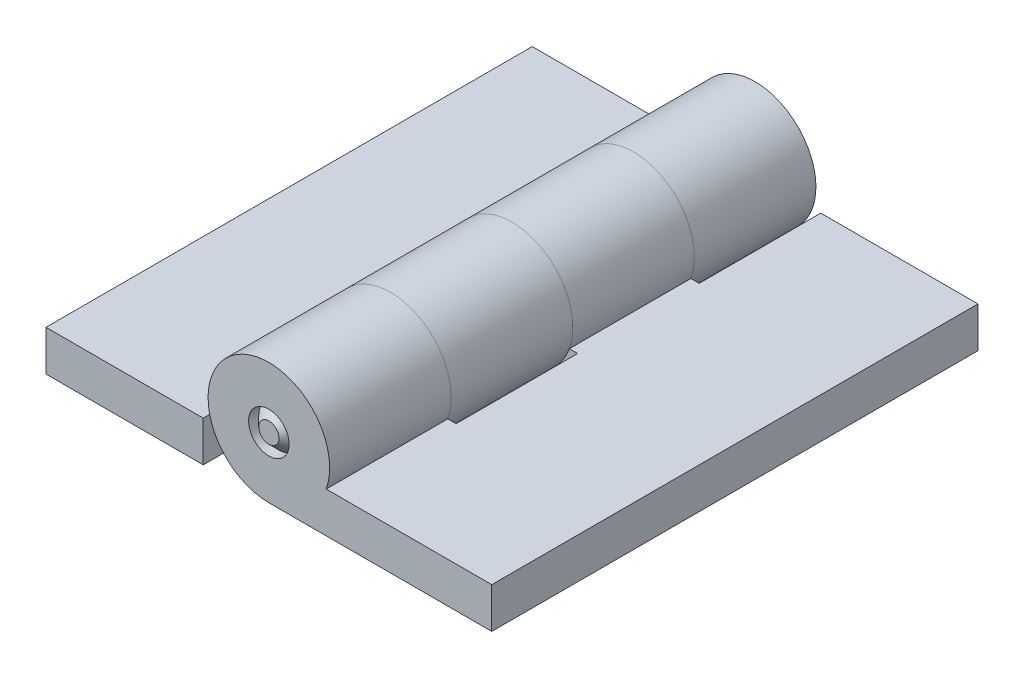
ISO-10303-21;
HEADER;
FILE_DESCRIPTION(('STEP AP214'),'2;1');
FILE_NAME('part.step','',(''),(''),'','','');
FILE_SCHEMA(('AUTOMOTIVE_DESIGN { 1 0 10303 214 1 1 1 1 }'));
ENDSEC;
DATA;
#1=APPLICATION_CONTEXT('core data for automotive mechanical design processes');
#2=APPLICATION_PROTOCOL_DEFINITION('international standard','automotive_design',2000,#1);
#3=PRODUCT_CONTEXT('',#1,'mechanical');
#4=PRODUCT('Part','Part','',(#3));
#5=PRODUCT_RELATED_PRODUCT_CATEGORY('part','',(#4));
#6=PRODUCT_DEFINITION_FORMATION('','',#4);
#7=PRODUCT_DEFINITION_CONTEXT('part definition',#1,'design');
#8=PRODUCT_DEFINITION('design','',#6,#7);
#9=PRODUCT_DEFINITION_SHAPE('','',#8);
#10=(LENGTH_UNIT() NAMED_UNIT(*) SI_UNIT(.MILLI.,.METRE.));
#11=(NAMED_UNIT(*) PLANE_ANGLE_UNIT() SI_UNIT($,.RADIAN.));
#12=(NAMED_UNIT(*) SI_UNIT($,.STERADIAN.) SOLID_ANGLE_UNIT());
#13=UNCERTAINTY_MEASURE_WITH_UNIT(LENGTH_MEASURE(1.E-05),#10,'distance_accuracy_value','');
#14=(GEOMETRIC_REPRESENTATION_CONTEXT(3) GLOBAL_UNCERTAINTY_ASSIGNED_CONTEXT((#13)) GLOBAL_UNIT_ASSIGNED_CONTEXT((#10,
#11,#12)) REPRESENTATION_CONTEXT('',''));
#15=CARTESIAN_POINT('',(0.,0.,0.));
#16=DIRECTION('',(0.,0.,1.));
#17=DIRECTION('',(1.,0.,0.));
#18=AXIS2_PLACEMENT_3D('',#15,#16,#17);
#19=CARTESIAN_POINT('',(0.,0.,-16.66875));
#20=DIRECTION('',(0.,0.,-1.));
#21=DIRECTION('',(1.,0.,0.));
#22=AXIS2_PLACEMENT_3D('',#19,#20,#21);
#23=SPHERICAL_SURFACE('',#22,3.96875);
#24=CARTESIAN_POINT('',(0.,0.,-19.05));
#25=DIRECTION('',(0.,0.,-1.));
#26=DIRECTION('',(-1.,0.,0.));
#27=AXIS2_PLACEMENT_3D('',#24,#25,#26);
#28=CIRCLE('',#27,3.175);
#29=CARTESIAN_POINT('',(-3.175,0.,-19.05));
#30=VERTEX_POINT('',#29);
#31=EDGE_CURVE('E58',#30,#30,#28,.T.);
#32=ORIENTED_EDGE('',*,*,#31,.T.);
#33=EDGE_LOOP('',(#32));
#34=FACE_BOUND('',#33,.T.);
#35=ADVANCED_FACE('F43',(#34),#23,.T.);
#36=CARTESIAN_POINT('',(0.,0.,-20.6375));
#37=DIRECTION('',(0.,0.,-1.));
#38=DIRECTION('',(-1.,0.,0.));
#39=AXIS2_PLACEMENT_3D('',#36,#37,#38);
#40=CYLINDRICAL_SURFACE('',#39,1.5875);
#41=CARTESIAN_POINT('',(0.,0.,18.25625));
#42=DIRECTION('',(0.,0.,-1.));
#43=DIRECTION('',(-1.,0.,0.));
#44=AXIS2_PLACEMENT_3D('',#41,#42,#43);
#45=CIRCLE('',#44,1.5875);
#46=CARTESIAN_POINT('',(-1.5875,0.,18.25625));
#47=VERTEX_POINT('',#46);
#48=EDGE_CURVE('E11',#47,#47,#45,.T.);
#49=ORIENTED_EDGE('',*,*,#48,.T.);
#50=EDGE_LOOP('',(#49));
#51=FACE_BOUND('',#50,.T.);
#52=CARTESIAN_POINT('',(0.,0.,-19.05));
#53=DIRECTION('',(0.,0.,-1.));
#54=DIRECTION('',(-1.,0.,0.));
#55=AXIS2_PLACEMENT_3D('',#52,#53,#54);
#56=CIRCLE('',#55,1.5875);
#57=CARTESIAN_POINT('',(-1.5875,0.,-19.05));
#58=VERTEX_POINT('',#57);
#59=EDGE_CURVE('E54',#58,#58,#56,.T.);
#60=ORIENTED_EDGE('',*,*,#59,.F.);
#61=EDGE_LOOP('',(#60));
#62=FACE_BOUND('',#61,.T.);
#63=ADVANCED_FACE('F68',(#51,#62),#40,.T.);
#64=CARTESIAN_POINT('',(-3.175,0.,-19.05));
#65=DIRECTION('',(0.,0.,1.));
#66=DIRECTION('',(1.,0.,0.));
#67=AXIS2_PLACEMENT_3D('',#64,#65,#66);
#68=PLANE('',#67);
#69=ORIENTED_EDGE('',*,*,#59,.T.);
#70=EDGE_LOOP('',(#69));
#71=FACE_BOUND('',#70,.T.);
#72=ORIENTED_EDGE('',*,*,#31,.F.);
#73=EDGE_LOOP('',(#72));
#74=FACE_BOUND('',#73,.T.);
#75=ADVANCED_FACE('F65',(#71,#74),#68,.T.);
#76=CARTESIAN_POINT('',(-17.4625,-4.76255,19.05));
#77=DIRECTION('',(0.,0.,-1.));
#78=DIRECTION('',(-1.,0.,0.));
#79=AXIS2_PLACEMENT_3D('',#76,#77,#78);
#80=PLANE('',#79);
#81=CARTESIAN_POINT('',(0.,0.,19.05));
#82=DIRECTION('',(0.,0.,-1.));
#83=DIRECTION('',(-1.,0.,0.));
#84=AXIS2_PLACEMENT_3D('',#81,#82,#83);
#85=CIRCLE('',#84,0.793749999999999);
#86=CARTESIAN_POINT('',(-0.793749999999999,0.,19.05));
#87=VERTEX_POINT('',#86);
#88=EDGE_CURVE('E50',#87,#87,#85,.F.);
#89=ORIENTED_EDGE('',*,*,#88,.T.);
#90=EDGE_LOOP('',(#89));
#91=FACE_BOUND('',#90,.T.);
#92=ADVANCED_FACE('F67',(#91),#80,.F.);
#93=CARTESIAN_POINT('',(0.,0.,19.05));
#94=DIRECTION('',(0.,0.,-1.));
#95=DIRECTION('',(-1.,0.,0.));
#96=AXIS2_PLACEMENT_3D('',#93,#94,#95);
#97=CONICAL_SURFACE('',#96,0.793750000000003,0.785398163397449);
#98=ORIENTED_EDGE('',*,*,#48,.F.);
#99=EDGE_LOOP('',(#98));
#100=FACE_BOUND('',#99,.T.);
#101=ORIENTED_EDGE('',*,*,#88,.F.);
#102=EDGE_LOOP('',(#101));
#103=FACE_BOUND('',#102,.T.);
#104=ADVANCED_FACE('F45',(#100,#103),#97,.T.);
#105=CLOSED_SHELL('',(#35,#63,#75,#92,#104));
#106=MANIFOLD_SOLID_BREP('B2',#105);
#107=CARTESIAN_POINT('',(-5.1435,-1.5875,19.05));
#108=DIRECTION('',(-1.,0.,0.));
#109=DIRECTION('',(0.,-1.,0.));
#110=AXIS2_PLACEMENT_3D('',#107,#108,#109);
#111=PLANE('',#110);
#112=DIRECTION('',(0.,-1.,0.));
#113=VECTOR('',#112,1.);
#114=CARTESIAN_POINT('',(-5.1435,-1.5875,0.));
#115=LINE('',#114,#113);
#116=CARTESIAN_POINT('',(-5.1435,-1.5875,0.));
#117=VERTEX_POINT('',#116);
#118=CARTESIAN_POINT('',(-5.1435,-4.7625,0.));
#119=VERTEX_POINT('',#118);
#120=EDGE_CURVE('E141',#117,#119,#115,.T.);
#121=ORIENTED_EDGE('',*,*,#120,.T.);
#122=DIRECTION('',(0.,0.,-1.));
#123=VECTOR('',#122,1.);
#124=CARTESIAN_POINT('',(-5.1435,-4.7625,19.05));
#125=LINE('',#124,#123);
#126=CARTESIAN_POINT('',(-5.1435,-4.7625,-9.525));
#127=VERTEX_POINT('',#126);
#128=EDGE_CURVE('E127',#119,#127,#125,.T.);
#129=ORIENTED_EDGE('',*,*,#128,.T.);
#130=DIRECTION('',(0.,-1.,0.));
#131=VECTOR('',#130,1.);
#132=CARTESIAN_POINT('',(-5.1435,-4.7625,-9.525));
#133=LINE('',#132,#131);
#134=CARTESIAN_POINT('',(-5.1435,-1.5875,-9.52499999999998));
#135=VERTEX_POINT('',#134);
#136=EDGE_CURVE('E251',#135,#127,#133,.T.);
#137=ORIENTED_EDGE('',*,*,#136,.F.);
#138=DIRECTION('',(0.,0.,-1.));
#139=VECTOR('',#138,1.);
#140=CARTESIAN_POINT('',(-5.1435,-1.5875,19.05));
#141=LINE('',#140,#139);
#142=EDGE_CURVE('E148',#117,#135,#141,.T.);
#143=ORIENTED_EDGE('',*,*,#142,.F.);
#144=EDGE_LOOP('',(#121,#129,#137,#143));
#145=FACE_BOUND('',#144,.T.);
#146=ADVANCED_FACE('F123',(#145),#111,.F.);
#147=CARTESIAN_POINT('',(-5.1435,-4.7625,19.05));
#148=VERTEX_POINT('',#147);
#149=CARTESIAN_POINT('',(-5.1435,-4.7625,9.525));
#150=VERTEX_POINT('',#149);
#151=EDGE_CURVE('E133',#148,#150,#125,.T.);
#152=ORIENTED_EDGE('',*,*,#151,.T.);
#153=DIRECTION('',(0.,-1.,0.));
#154=VECTOR('',#153,1.);
#155=CARTESIAN_POINT('',(-5.1435,-1.5875,9.525));
#156=LINE('',#155,#154);
#157=CARTESIAN_POINT('',(-5.1435,-1.5875,9.525));
#158=VERTEX_POINT('',#157);
#159=EDGE_CURVE('E227',#158,#150,#156,.T.);
#160=ORIENTED_EDGE('',*,*,#159,.F.);
#161=CARTESIAN_POINT('',(-5.1435,-1.5875,19.05));
#162=VERTEX_POINT('',#161);
#163=EDGE_CURVE('E263',#162,#158,#141,.T.);
#164=ORIENTED_EDGE('',*,*,#163,.F.);
#165=DIRECTION('',(0.,1.,0.));
#166=VECTOR('',#165,1.);
#167=CARTESIAN_POINT('',(-5.1435,-1.5875,19.05));
#168=LINE('',#167,#166);
#169=EDGE_CURVE('E291',#148,#162,#168,.T.);
#170=ORIENTED_EDGE('',*,*,#169,.F.);
#171=EDGE_LOOP('',(#152,#160,#164,#170));
#172=FACE_BOUND('',#171,.T.);
#173=ADVANCED_FACE('F321',(#172),#111,.F.);
#174=CARTESIAN_POINT('',(-17.4625,-1.5875,19.05));
#175=DIRECTION('',(1.,0.,0.));
#176=DIRECTION('',(0.,0.,-1.));
#177=AXIS2_PLACEMENT_3D('',#174,#175,#176);
#178=PLANE('',#177);
#179=DIRECTION('',(0.,-1.,0.));
#180=VECTOR('',#179,1.);
#181=CARTESIAN_POINT('',(-17.4625,-1.5875,-19.05));
#182=LINE('',#181,#180);
#183=CARTESIAN_POINT('',(-17.4625,-1.5875,-19.05));
#184=VERTEX_POINT('',#183);
#185=CARTESIAN_POINT('',(-17.4625,-4.7625,-19.05));
#186=VERTEX_POINT('',#185);
#187=EDGE_CURVE('E295',#184,#186,#182,.T.);
#188=ORIENTED_EDGE('',*,*,#187,.T.);
#189=DIRECTION('',(0.,0.,-1.));
#190=VECTOR('',#189,1.);
#191=CARTESIAN_POINT('',(-17.4625,-4.7625,19.05));
#192=LINE('',#191,#190);
#193=CARTESIAN_POINT('',(-17.4625,-4.7625,19.05));
#194=VERTEX_POINT('',#193);
#195=EDGE_CURVE('E41',#194,#186,#192,.T.);
#196=ORIENTED_EDGE('',*,*,#195,.F.);
#197=DIRECTION('',(0.,-1.,0.));
#198=VECTOR('',#197,1.);
#199=CARTESIAN_POINT('',(-17.4625,-1.5875,19.05));
#200=LINE('',#199,#198);
#201=CARTESIAN_POINT('',(-17.4625,-1.5875,19.05));
#202=VERTEX_POINT('',#201);
#203=EDGE_CURVE('E285',#202,#194,#200,.T.);
#204=ORIENTED_EDGE('',*,*,#203,.F.);
#205=DIRECTION('',(0.,0.,-1.));
#206=VECTOR('',#205,1.);
#207=CARTESIAN_POINT('',(-17.4625,-1.5875,19.05));
#208=LINE('',#207,#206);
#209=EDGE_CURVE('E264',#202,#184,#208,.T.);
#210=ORIENTED_EDGE('',*,*,#209,.T.);
#211=EDGE_LOOP('',(#188,#196,#204,#210));
#212=FACE_BOUND('',#211,.T.);
#213=ADVANCED_FACE('F125',(#212),#178,.F.);
#214=CARTESIAN_POINT('',(-17.4625,-4.7625,19.05));
#215=DIRECTION('',(0.,1.,0.));
#216=DIRECTION('',(0.,0.,1.));
#217=AXIS2_PLACEMENT_3D('',#214,#215,#216);
#218=PLANE('',#217);
#219=DIRECTION('',(1.,0.,0.));
#220=VECTOR('',#219,1.);
#221=CARTESIAN_POINT('',(-17.4625,-4.7625,-19.05));
#222=LINE('',#221,#220);
#223=CARTESIAN_POINT('',(0.,-4.7625,-19.05));
#224=VERTEX_POINT('',#223);
#225=EDGE_CURVE('E298',#186,#224,#222,.T.);
#226=ORIENTED_EDGE('',*,*,#225,.T.);
#227=DIRECTION('',(0.,0.,-1.));
#228=VECTOR('',#227,1.);
#229=CARTESIAN_POINT('',(0.,-4.7625,4.21743286321604));
#230=LINE('',#229,#228);
#231=CARTESIAN_POINT('',(0.,-4.7625,-9.525));
#232=VERTEX_POINT('',#231);
#233=EDGE_CURVE('E462',#232,#224,#230,.T.);
#234=ORIENTED_EDGE('',*,*,#233,.F.);
#235=DIRECTION('',(1.,0.,0.));
#236=VECTOR('',#235,1.);
#237=CARTESIAN_POINT('',(0.,-4.7625,-9.525));
#238=LINE('',#237,#236);
#239=EDGE_CURVE('E256',#127,#232,#238,.T.);
#240=ORIENTED_EDGE('',*,*,#239,.F.);
#241=ORIENTED_EDGE('',*,*,#128,.F.);
#242=DIRECTION('',(1.,0.,0.));
#243=VECTOR('',#242,1.);
#244=CARTESIAN_POINT('',(-5.1435,-4.7625,0.));
#245=LINE('',#244,#243);
#246=CARTESIAN_POINT('',(0.,-4.7625,0.));
#247=VERTEX_POINT('',#246);
#248=EDGE_CURVE('E211',#119,#247,#245,.T.);
#249=ORIENTED_EDGE('',*,*,#248,.T.);
#250=DIRECTION('',(0.,0.,-1.));
#251=VECTOR('',#250,1.);
#252=CARTESIAN_POINT('',(0.,-4.7625,23.267432863216));
#253=LINE('',#252,#251);
#254=CARTESIAN_POINT('',(0.,-4.7625,9.525));
#255=VERTEX_POINT('',#254);
#256=EDGE_CURVE('E203',#255,#247,#253,.T.);
#257=ORIENTED_EDGE('',*,*,#256,.F.);
#258=DIRECTION('',(1.,0.,0.));
#259=VECTOR('',#258,1.);
#260=CARTESIAN_POINT('',(-5.1435,-4.7625,9.525));
#261=LINE('',#260,#259);
#262=EDGE_CURVE('E208',#150,#255,#261,.T.);
#263=ORIENTED_EDGE('',*,*,#262,.F.);
#264=ORIENTED_EDGE('',*,*,#151,.F.);
#265=DIRECTION('',(1.,0.,0.));
#266=VECTOR('',#265,1.);
#267=CARTESIAN_POINT('',(-17.4625,-4.7625,19.05));
#268=LINE('',#267,#266);
#269=EDGE_CURVE('E288',#194,#148,#268,.T.);
#270=ORIENTED_EDGE('',*,*,#269,.F.);
#271=ORIENTED_EDGE('',*,*,#195,.T.);
#272=EDGE_LOOP('',(#226,#234,#240,#241,#249,#257,#263,#264,#270,#271));
#273=FACE_BOUND('',#272,.T.);
#274=ADVANCED_FACE('F205',(#273),#218,.F.);
#275=CARTESIAN_POINT('',(-17.4625,-1.5875,19.05));
#276=DIRECTION('',(0.,-1.,0.));
#277=DIRECTION('',(0.,0.,-1.));
#278=AXIS2_PLACEMENT_3D('',#275,#276,#277);
#279=PLANE('',#278);
#280=DIRECTION('',(-1.,0.,0.));
#281=VECTOR('',#280,1.);
#282=CARTESIAN_POINT('',(-17.4625,-1.5875,-19.05));
#283=LINE('',#282,#281);
#284=CARTESIAN_POINT('',(-4.49012806053458,-1.5875,-19.05));
#285=VERTEX_POINT('',#284);
#286=EDGE_CURVE('E289',#285,#184,#283,.T.);
#287=ORIENTED_EDGE('',*,*,#286,.T.);
#288=ORIENTED_EDGE('',*,*,#209,.F.);
#289=DIRECTION('',(-1.,0.,0.));
#290=VECTOR('',#289,1.);
#291=CARTESIAN_POINT('',(-17.4625,-1.5875,19.05));
#292=LINE('',#291,#290);
#293=EDGE_CURVE('E293',#162,#202,#292,.T.);
#294=ORIENTED_EDGE('',*,*,#293,.F.);
#295=ORIENTED_EDGE('',*,*,#163,.T.);
#296=DIRECTION('',(-1.,0.,0.));
#297=VECTOR('',#296,1.);
#298=CARTESIAN_POINT('',(-4.49012806053458,-1.5875,9.525));
#299=LINE('',#298,#297);
#300=CARTESIAN_POINT('',(-4.49012806053458,-1.5875,9.525));
#301=VERTEX_POINT('',#300);
#302=EDGE_CURVE('E223',#301,#158,#299,.T.);
#303=ORIENTED_EDGE('',*,*,#302,.F.);
#304=DIRECTION('',(0.,0.,-1.));
#305=VECTOR('',#304,1.);
#306=CARTESIAN_POINT('',(-4.49012806053458,-1.5875,23.267432863216));
#307=LINE('',#306,#305);
#308=CARTESIAN_POINT('',(-4.49012806053458,-1.5875,0.));
#309=VERTEX_POINT('',#308);
#310=EDGE_CURVE('E215',#301,#309,#307,.T.);
#311=ORIENTED_EDGE('',*,*,#310,.T.);
#312=DIRECTION('',(-1.,0.,0.));
#313=VECTOR('',#312,1.);
#314=CARTESIAN_POINT('',(-4.49012806053458,-1.5875,0.));
#315=LINE('',#314,#313);
#316=EDGE_CURVE('E240',#309,#117,#315,.T.);
#317=ORIENTED_EDGE('',*,*,#316,.T.);
#318=ORIENTED_EDGE('',*,*,#142,.T.);
#319=DIRECTION('',(-1.,0.,0.));
#320=VECTOR('',#319,1.);
#321=CARTESIAN_POINT('',(-5.1435,-1.5875,-9.525));
#322=LINE('',#321,#320);
#323=CARTESIAN_POINT('',(-4.49012806053458,-1.5875,-9.525));
#324=VERTEX_POINT('',#323);
#325=EDGE_CURVE('E255',#324,#135,#322,.T.);
#326=ORIENTED_EDGE('',*,*,#325,.F.);
#327=DIRECTION('',(0.,0.,-1.));
#328=VECTOR('',#327,1.);
#329=CARTESIAN_POINT('',(-4.49012806053458,-1.5875,4.21743286321604));
#330=LINE('',#329,#328);
#331=EDGE_CURVE('E283',#324,#285,#330,.T.);
#332=ORIENTED_EDGE('',*,*,#331,.T.);
#333=EDGE_LOOP('',(#287,#288,#294,#295,#303,#311,#317,#318,#326,#332));
#334=FACE_BOUND('',#333,.T.);
#335=ADVANCED_FACE('F302',(#334),#279,.F.);
#336=CARTESIAN_POINT('',(-17.4625,-4.7625,19.05));
#337=DIRECTION('',(0.,0.,1.));
#338=DIRECTION('',(1.,0.,0.));
#339=AXIS2_PLACEMENT_3D('',#336,#337,#338);
#340=PLANE('',#339);
#341=ORIENTED_EDGE('',*,*,#203,.T.);
#342=ORIENTED_EDGE('',*,*,#269,.T.);
#343=ORIENTED_EDGE('',*,*,#169,.T.);
#344=ORIENTED_EDGE('',*,*,#293,.T.);
#345=EDGE_LOOP('',(#341,#342,#343,#344));
#346=FACE_BOUND('',#345,.T.);
#347=ADVANCED_FACE('F318',(#346),#340,.T.);
#348=CARTESIAN_POINT('',(-17.4625,-4.7625,-19.05));
#349=DIRECTION('',(0.,0.,1.));
#350=DIRECTION('',(1.,0.,0.));
#351=AXIS2_PLACEMENT_3D('',#348,#349,#350);
#352=PLANE('',#351);
#353=ORIENTED_EDGE('',*,*,#187,.F.);
#354=ORIENTED_EDGE('',*,*,#286,.F.);
#355=CARTESIAN_POINT('',(0.,0.,-19.05));
#356=DIRECTION('',(0.,0.,1.));
#357=DIRECTION('',(1.,0.,0.));
#358=AXIS2_PLACEMENT_3D('',#355,#356,#357);
#359=CIRCLE('',#358,4.7625);
#360=EDGE_CURVE('E314',#224,#285,#359,.T.);
#361=ORIENTED_EDGE('',*,*,#360,.F.);
#362=ORIENTED_EDGE('',*,*,#225,.F.);
#363=EDGE_LOOP('',(#353,#354,#361,#362));
#364=FACE_BOUND('',#363,.T.);
#365=CARTESIAN_POINT('',(0.,0.,-19.05));
#366=DIRECTION('',(0.,0.,1.));
#367=DIRECTION('',(1.,0.,0.));
#368=AXIS2_PLACEMENT_3D('',#365,#366,#367);
#369=CIRCLE('',#368,1.5875);
#370=CARTESIAN_POINT('',(1.5875,0.,-19.05));
#371=VERTEX_POINT('',#370);
#372=EDGE_CURVE('E463',#371,#371,#369,.T.);
#373=ORIENTED_EDGE('',*,*,#372,.T.);
#374=EDGE_LOOP('',(#373));
#375=FACE_BOUND('',#374,.T.);
#376=ADVANCED_FACE('F312',(#364,#375),#352,.F.);
#377=CARTESIAN_POINT('',(0.,0.,4.21743286321604));
#378=DIRECTION('',(0.,0.,-1.));
#379=DIRECTION('',(-1.,0.,0.));
#380=AXIS2_PLACEMENT_3D('',#377,#378,#379);
#381=CYLINDRICAL_SURFACE('',#380,4.7625);
#382=CARTESIAN_POINT('',(0.,0.,-9.525));
#383=DIRECTION('',(0.,0.,1.));
#384=DIRECTION('',(1.,0.,0.));
#385=AXIS2_PLACEMENT_3D('',#382,#383,#384);
#386=CIRCLE('',#385,4.7625);
#387=EDGE_CURVE('E248',#232,#324,#386,.T.);
#388=ORIENTED_EDGE('',*,*,#387,.F.);
#389=ORIENTED_EDGE('',*,*,#233,.T.);
#390=ORIENTED_EDGE('',*,*,#360,.T.);
#391=ORIENTED_EDGE('',*,*,#331,.F.);
#392=EDGE_LOOP('',(#388,#389,#390,#391));
#393=FACE_BOUND('',#392,.T.);
#394=ADVANCED_FACE('F342',(#393),#381,.T.);
#395=CARTESIAN_POINT('',(0.,0.,4.21743286321604));
#396=DIRECTION('',(0.,0.,-1.));
#397=DIRECTION('',(-1.,0.,0.));
#398=AXIS2_PLACEMENT_3D('',#395,#396,#397);
#399=CYLINDRICAL_SURFACE('',#398,1.5875);
#400=ORIENTED_EDGE('',*,*,#372,.F.);
#401=EDGE_LOOP('',(#400));
#402=FACE_BOUND('',#401,.T.);
#403=CARTESIAN_POINT('',(0.,0.,-9.525));
#404=DIRECTION('',(0.,0.,1.));
#405=DIRECTION('',(1.,0.,0.));
#406=AXIS2_PLACEMENT_3D('',#403,#404,#405);
#407=CIRCLE('',#406,1.5875);
#408=CARTESIAN_POINT('',(1.5875,0.,-9.525));
#409=VERTEX_POINT('',#408);
#410=EDGE_CURVE('E244',#409,#409,#407,.T.);
#411=ORIENTED_EDGE('',*,*,#410,.T.);
#412=EDGE_LOOP('',(#411));
#413=FACE_BOUND('',#412,.T.);
#414=ADVANCED_FACE('F346',(#402,#413),#399,.F.);
#415=CARTESIAN_POINT('',(-5.1435,-4.7625,-9.525));
#416=DIRECTION('',(0.,0.,1.));
#417=DIRECTION('',(1.,0.,0.));
#418=AXIS2_PLACEMENT_3D('',#415,#416,#417);
#419=PLANE('',#418);
#420=ORIENTED_EDGE('',*,*,#410,.F.);
#421=EDGE_LOOP('',(#420));
#422=FACE_BOUND('',#421,.T.);
#423=ORIENTED_EDGE('',*,*,#239,.T.);
#424=ORIENTED_EDGE('',*,*,#387,.T.);
#425=ORIENTED_EDGE('',*,*,#325,.T.);
#426=ORIENTED_EDGE('',*,*,#136,.T.);
#427=EDGE_LOOP('',(#423,#424,#425,#426));
#428=FACE_BOUND('',#427,.T.);
#429=ADVANCED_FACE('F350',(#422,#428),#419,.T.);
#430=CARTESIAN_POINT('',(0.,0.,23.267432863216));
#431=DIRECTION('',(0.,0.,-1.));
#432=DIRECTION('',(-1.,0.,0.));
#433=AXIS2_PLACEMENT_3D('',#430,#431,#432);
#434=CYLINDRICAL_SURFACE('',#433,4.7625);
#435=CARTESIAN_POINT('',(0.,0.,9.525));
#436=DIRECTION('',(0.,0.,1.));
#437=DIRECTION('',(1.,0.,0.));
#438=AXIS2_PLACEMENT_3D('',#435,#436,#437);
#439=CIRCLE('',#438,4.7625);
#440=EDGE_CURVE('E219',#255,#301,#439,.T.);
#441=ORIENTED_EDGE('',*,*,#440,.F.);
#442=ORIENTED_EDGE('',*,*,#256,.T.);
#443=CARTESIAN_POINT('',(0.,0.,0.));
#444=DIRECTION('',(0.,0.,1.));
#445=DIRECTION('',(1.,0.,0.));
#446=AXIS2_PLACEMENT_3D('',#443,#444,#445);
#447=CIRCLE('',#446,4.7625);
#448=EDGE_CURVE('E238',#247,#309,#447,.T.);
#449=ORIENTED_EDGE('',*,*,#448,.T.);
#450=ORIENTED_EDGE('',*,*,#310,.F.);
#451=EDGE_LOOP('',(#441,#442,#449,#450));
#452=FACE_BOUND('',#451,.T.);
#453=ADVANCED_FACE('F220',(#452),#434,.T.);
#454=CARTESIAN_POINT('',(0.,0.,0.));
#455=DIRECTION('',(0.,0.,1.));
#456=DIRECTION('',(1.,0.,0.));
#457=AXIS2_PLACEMENT_3D('',#454,#455,#456);
#458=PLANE('',#457);
#459=ORIENTED_EDGE('',*,*,#448,.F.);
#460=ORIENTED_EDGE('',*,*,#248,.F.);
#461=ORIENTED_EDGE('',*,*,#120,.F.);
#462=ORIENTED_EDGE('',*,*,#316,.F.);
#463=EDGE_LOOP('',(#459,#460,#461,#462));
#464=FACE_BOUND('',#463,.T.);
#465=CARTESIAN_POINT('',(0.,0.,0.));
#466=DIRECTION('',(0.,0.,1.));
#467=DIRECTION('',(1.,0.,0.));
#468=AXIS2_PLACEMENT_3D('',#465,#466,#467);
#469=CIRCLE('',#468,1.5875);
#470=CARTESIAN_POINT('',(1.5875,0.,0.));
#471=VERTEX_POINT('',#470);
#472=EDGE_CURVE('E222',#471,#471,#469,.T.);
#473=ORIENTED_EDGE('',*,*,#472,.T.);
#474=EDGE_LOOP('',(#473));
#475=FACE_BOUND('',#474,.T.);
#476=ADVANCED_FACE('F357',(#464,#475),#458,.F.);
#477=CARTESIAN_POINT('',(0.,0.,23.267432863216));
#478=DIRECTION('',(0.,0.,-1.));
#479=DIRECTION('',(-1.,0.,0.));
#480=AXIS2_PLACEMENT_3D('',#477,#478,#479);
#481=CYLINDRICAL_SURFACE('',#480,1.5875);
#482=ORIENTED_EDGE('',*,*,#472,.F.);
#483=EDGE_LOOP('',(#482));
#484=FACE_BOUND('',#483,.T.);
#485=CARTESIAN_POINT('',(0.,0.,9.525));
#486=DIRECTION('',(0.,0.,1.));
#487=DIRECTION('',(1.,0.,0.));
#488=AXIS2_PLACEMENT_3D('',#485,#486,#487);
#489=CIRCLE('',#488,1.5875);
#490=CARTESIAN_POINT('',(1.5875,0.,9.525));
#491=VERTEX_POINT('',#490);
#492=EDGE_CURVE('E229',#491,#491,#489,.T.);
#493=ORIENTED_EDGE('',*,*,#492,.T.);
#494=EDGE_LOOP('',(#493));
#495=FACE_BOUND('',#494,.T.);
#496=ADVANCED_FACE('F360',(#484,#495),#481,.F.);
#497=CARTESIAN_POINT('',(-5.1435,-4.7625,9.525));
#498=DIRECTION('',(0.,0.,1.));
#499=DIRECTION('',(1.,0.,0.));
#500=AXIS2_PLACEMENT_3D('',#497,#498,#499);
#501=PLANE('',#500);
#502=ORIENTED_EDGE('',*,*,#492,.F.);
#503=EDGE_LOOP('',(#502));
#504=FACE_BOUND('',#503,.T.);
#505=ORIENTED_EDGE('',*,*,#262,.T.);
#506=ORIENTED_EDGE('',*,*,#440,.T.);
#507=ORIENTED_EDGE('',*,*,#302,.T.);
#508=ORIENTED_EDGE('',*,*,#159,.T.);
#509=EDGE_LOOP('',(#505,#506,#507,#508));
#510=FACE_BOUND('',#509,.T.);
#511=ADVANCED_FACE('F225',(#504,#510),#501,.T.);
#512=CLOSED_SHELL('',(#146,#173,#213,#274,#335,#347,#376,#394,#414,#429,#453,#476,#496,#511));
#513=MANIFOLD_SOLID_BREP('B6',#512);
#514=CARTESIAN_POINT('',(0.,0.,19.05));
#515=DIRECTION('',(0.,0.,-1.));
#516=DIRECTION('',(-1.,0.,0.));
#517=AXIS2_PLACEMENT_3D('',#514,#515,#516);
#518=CYLINDRICAL_SURFACE('',#517,4.7625);
#519=CARTESIAN_POINT('',(0.,0.,9.525));
#520=DIRECTION('',(0.,0.,1.));
#521=DIRECTION('',(1.,0.,0.));
#522=AXIS2_PLACEMENT_3D('',#519,#520,#521);
#523=CIRCLE('',#522,4.7625);
#524=CARTESIAN_POINT('',(4.49012806053458,-1.58749999999999,9.525));
#525=VERTEX_POINT('',#524);
#526=CARTESIAN_POINT('',(0.,-4.7625,9.525));
#527=VERTEX_POINT('',#526);
#528=EDGE_CURVE('E577',#525,#527,#523,.T.);
#529=ORIENTED_EDGE('',*,*,#528,.T.);
#530=DIRECTION('',(0.,0.,-1.));
#531=VECTOR('',#530,1.);
#532=CARTESIAN_POINT('',(0.,-4.7625,19.05));
#533=LINE('',#532,#531);
#534=CARTESIAN_POINT('',(0.,-4.7625,19.05));
#535=VERTEX_POINT('',#534);
#536=EDGE_CURVE('E629',#535,#527,#533,.T.);
#537=ORIENTED_EDGE('',*,*,#536,.F.);
#538=CARTESIAN_POINT('',(0.,0.,19.05));
#539=DIRECTION('',(0.,0.,1.));
#540=DIRECTION('',(-1.,0.,0.));
#541=AXIS2_PLACEMENT_3D('',#538,#539,#540);
#542=CIRCLE('',#541,4.7625);
#543=CARTESIAN_POINT('',(4.49012806053458,-1.5875,19.05));
#544=VERTEX_POINT('',#543);
#545=EDGE_CURVE('E615',#544,#535,#542,.T.);
#546=ORIENTED_EDGE('',*,*,#545,.F.);
#547=DIRECTION('',(0.,0.,-1.));
#548=VECTOR('',#547,1.);
#549=CARTESIAN_POINT('',(4.49012806053458,-1.5875,19.05));
#550=LINE('',#549,#548);
#551=EDGE_CURVE('E480',#544,#525,#550,.T.);
#552=ORIENTED_EDGE('',*,*,#551,.T.);
#553=EDGE_LOOP('',(#529,#537,#546,#552));
#554=FACE_BOUND('',#553,.T.);
#555=ADVANCED_FACE('F471',(#554),#518,.T.);
#556=CARTESIAN_POINT('',(0.,0.,19.05));
#557=DIRECTION('',(0.,0.,-1.));
#558=DIRECTION('',(-1.,0.,0.));
#559=AXIS2_PLACEMENT_3D('',#556,#557,#558);
#560=CYLINDRICAL_SURFACE('',#559,1.5875);
#561=CARTESIAN_POINT('',(0.,0.,0.));
#562=DIRECTION('',(0.,0.,-1.));
#563=DIRECTION('',(-1.,0.,0.));
#564=AXIS2_PLACEMENT_3D('',#561,#562,#563);
#565=CIRCLE('',#564,1.5875);
#566=CARTESIAN_POINT('',(-1.5875,0.,0.));
#567=VERTEX_POINT('',#566);
#568=EDGE_CURVE('E475',#567,#567,#565,.T.);
#569=ORIENTED_EDGE('',*,*,#568,.F.);
#570=EDGE_LOOP('',(#569));
#571=FACE_BOUND('',#570,.T.);
#572=CARTESIAN_POINT('',(0.,0.,-9.525));
#573=DIRECTION('',(0.,0.,1.));
#574=DIRECTION('',(1.,0.,0.));
#575=AXIS2_PLACEMENT_3D('',#572,#573,#574);
#576=CIRCLE('',#575,1.5875);
#577=CARTESIAN_POINT('',(1.5875,0.,-9.525));
#578=VERTEX_POINT('',#577);
#579=EDGE_CURVE('E594',#578,#578,#576,.T.);
#580=ORIENTED_EDGE('',*,*,#579,.F.);
#581=EDGE_LOOP('',(#580));
#582=FACE_BOUND('',#581,.T.);
#583=ADVANCED_FACE('F646',(#571,#582),#560,.F.);
#584=CARTESIAN_POINT('',(0.,0.,19.05));
#585=DIRECTION('',(0.,0.,-1.));
#586=DIRECTION('',(-1.,0.,0.));
#587=AXIS2_PLACEMENT_3D('',#584,#585,#586);
#588=PLANE('',#587);
#589=DIRECTION('',(0.,1.,0.));
#590=VECTOR('',#589,1.);
#591=CARTESIAN_POINT('',(17.4625,-4.7625,19.05));
#592=LINE('',#591,#590);
#593=CARTESIAN_POINT('',(17.4625,-4.7625,19.05));
#594=VERTEX_POINT('',#593);
#595=CARTESIAN_POINT('',(17.4625,-1.5875,19.05));
#596=VERTEX_POINT('',#595);
#597=EDGE_CURVE('E609',#594,#596,#592,.T.);
#598=ORIENTED_EDGE('',*,*,#597,.T.);
#599=DIRECTION('',(-1.,0.,0.));
#600=VECTOR('',#599,1.);
#601=CARTESIAN_POINT('',(17.4625,-1.5875,19.05));
#602=LINE('',#601,#600);
#603=EDGE_CURVE('E612',#596,#544,#602,.T.);
#604=ORIENTED_EDGE('',*,*,#603,.T.);
#605=ORIENTED_EDGE('',*,*,#545,.T.);
#606=DIRECTION('',(1.,0.,0.));
#607=VECTOR('',#606,1.);
#608=CARTESIAN_POINT('',(17.4625,-4.7625,19.05));
#609=LINE('',#608,#607);
#610=EDGE_CURVE('E617',#535,#594,#609,.T.);
#611=ORIENTED_EDGE('',*,*,#610,.T.);
#612=EDGE_LOOP('',(#598,#604,#605,#611));
#613=FACE_BOUND('',#612,.T.);
#614=CARTESIAN_POINT('',(0.,0.,19.05));
#615=DIRECTION('',(0.,0.,1.));
#616=DIRECTION('',(1.,0.,0.));
#617=AXIS2_PLACEMENT_3D('',#614,#615,#616);
#618=CIRCLE('',#617,1.5875);
#619=CARTESIAN_POINT('',(1.5875,0.,19.05));
#620=VERTEX_POINT('',#619);
#621=EDGE_CURVE('E605',#620,#620,#618,.T.);
#622=ORIENTED_EDGE('',*,*,#621,.F.);
#623=EDGE_LOOP('',(#622));
#624=FACE_BOUND('',#623,.T.);
#625=ADVANCED_FACE('F649',(#613,#624),#588,.F.);
#626=CARTESIAN_POINT('',(0.,0.,-19.05));
#627=DIRECTION('',(0.,0.,-1.));
#628=DIRECTION('',(-1.,0.,0.));
#629=AXIS2_PLACEMENT_3D('',#626,#627,#628);
#630=PLANE('',#629);
#631=DIRECTION('',(0.,1.,0.));
#632=VECTOR('',#631,1.);
#633=CARTESIAN_POINT('',(5.1435,-4.7625,-19.05));
#634=LINE('',#633,#632);
#635=CARTESIAN_POINT('',(5.1435,-4.7625,-19.05));
#636=VERTEX_POINT('',#635);
#637=CARTESIAN_POINT('',(5.1435,-1.5875,-19.05));
#638=VERTEX_POINT('',#637);
#639=EDGE_CURVE('E591',#636,#638,#634,.T.);
#640=ORIENTED_EDGE('',*,*,#639,.T.);
#641=DIRECTION('',(-1.,0.,0.));
#642=VECTOR('',#641,1.);
#643=CARTESIAN_POINT('',(17.4625,-1.5875,-19.05));
#644=LINE('',#643,#642);
#645=CARTESIAN_POINT('',(17.4625,-1.5875,-19.05));
#646=VERTEX_POINT('',#645);
#647=EDGE_CURVE('E622',#646,#638,#644,.T.);
#648=ORIENTED_EDGE('',*,*,#647,.F.);
#649=DIRECTION('',(0.,1.,0.));
#650=VECTOR('',#649,1.);
#651=CARTESIAN_POINT('',(17.4625,-4.7625,-19.05));
#652=LINE('',#651,#650);
#653=CARTESIAN_POINT('',(17.4625,-4.7625,-19.05));
#654=VERTEX_POINT('',#653);
#655=EDGE_CURVE('E608',#654,#646,#652,.T.);
#656=ORIENTED_EDGE('',*,*,#655,.F.);
#657=DIRECTION('',(1.,0.,0.));
#658=VECTOR('',#657,1.);
#659=CARTESIAN_POINT('',(17.4625,-4.7625,-19.05));
#660=LINE('',#659,#658);
#661=EDGE_CURVE('E613',#636,#654,#660,.T.);
#662=ORIENTED_EDGE('',*,*,#661,.F.);
#663=EDGE_LOOP('',(#640,#648,#656,#662));
#664=FACE_BOUND('',#663,.T.);
#665=ADVANCED_FACE('F651',(#664),#630,.T.);
#666=CARTESIAN_POINT('',(17.4625,-4.7625,19.05));
#667=DIRECTION('',(-1.,0.,0.));
#668=DIRECTION('',(0.,0.,1.));
#669=AXIS2_PLACEMENT_3D('',#666,#667,#668);
#670=PLANE('',#669);
#671=ORIENTED_EDGE('',*,*,#655,.T.);
#672=DIRECTION('',(0.,0.,-1.));
#673=VECTOR('',#672,1.);
#674=CARTESIAN_POINT('',(17.4625,-1.5875,19.05));
#675=LINE('',#674,#673);
#676=EDGE_CURVE('E121',#596,#646,#675,.T.);
#677=ORIENTED_EDGE('',*,*,#676,.F.);
#678=ORIENTED_EDGE('',*,*,#597,.F.);
#679=DIRECTION('',(0.,0.,-1.));
#680=VECTOR('',#679,1.);
#681=CARTESIAN_POINT('',(17.4625,-4.7625,19.05));
#682=LINE('',#681,#680);
#683=EDGE_CURVE('E619',#594,#654,#682,.T.);
#684=ORIENTED_EDGE('',*,*,#683,.T.);
#685=EDGE_LOOP('',(#671,#677,#678,#684));
#686=FACE_BOUND('',#685,.T.);
#687=ADVANCED_FACE('F473',(#686),#670,.F.);
#688=CARTESIAN_POINT('',(17.4625,-1.5875,19.05));
#689=DIRECTION('',(0.,-1.,0.));
#690=DIRECTION('',(1.,0.,0.));
#691=AXIS2_PLACEMENT_3D('',#688,#689,#690);
#692=PLANE('',#691);
#693=CARTESIAN_POINT('',(4.49012806053458,-1.58749999999999,0.));
#694=VERTEX_POINT('',#693);
#695=CARTESIAN_POINT('',(4.49012806053458,-1.58749999999999,-9.525));
#696=VERTEX_POINT('',#695);
#697=EDGE_CURVE('E631',#694,#696,#550,.T.);
#698=ORIENTED_EDGE('',*,*,#697,.F.);
#699=DIRECTION('',(1.,0.,0.));
#700=VECTOR('',#699,1.);
#701=CARTESIAN_POINT('',(17.4625,-1.5875,0.));
#702=LINE('',#701,#700);
#703=CARTESIAN_POINT('',(5.1435,-1.5875,0.));
#704=VERTEX_POINT('',#703);
#705=EDGE_CURVE('E583',#694,#704,#702,.T.);
#706=ORIENTED_EDGE('',*,*,#705,.T.);
#707=DIRECTION('',(0.,0.,1.));
#708=VECTOR('',#707,1.);
#709=CARTESIAN_POINT('',(5.1435,-1.5875,19.05));
#710=LINE('',#709,#708);
#711=CARTESIAN_POINT('',(5.1435,-1.5875,9.525));
#712=VERTEX_POINT('',#711);
#713=EDGE_CURVE('E554',#704,#712,#710,.T.);
#714=ORIENTED_EDGE('',*,*,#713,.T.);
#715=DIRECTION('',(-1.,0.,0.));
#716=VECTOR('',#715,1.);
#717=CARTESIAN_POINT('',(17.4625,-1.5875,9.525));
#718=LINE('',#717,#716);
#719=EDGE_CURVE('E579',#712,#525,#718,.T.);
#720=ORIENTED_EDGE('',*,*,#719,.T.);
#721=ORIENTED_EDGE('',*,*,#551,.F.);
#722=ORIENTED_EDGE('',*,*,#603,.F.);
#723=ORIENTED_EDGE('',*,*,#676,.T.);
#724=ORIENTED_EDGE('',*,*,#647,.T.);
#725=DIRECTION('',(0.,0.,1.));
#726=VECTOR('',#725,1.);
#727=CARTESIAN_POINT('',(5.1435,-1.5875,19.05));
#728=LINE('',#727,#726);
#729=CARTESIAN_POINT('',(5.1435,-1.5875,-9.525));
#730=VERTEX_POINT('',#729);
#731=EDGE_CURVE('E602',#638,#730,#728,.T.);
#732=ORIENTED_EDGE('',*,*,#731,.T.);
#733=DIRECTION('',(-1.,0.,0.));
#734=VECTOR('',#733,1.);
#735=CARTESIAN_POINT('',(17.4625,-1.5875,-9.525));
#736=LINE('',#735,#734);
#737=EDGE_CURVE('E599',#730,#696,#736,.T.);
#738=ORIENTED_EDGE('',*,*,#737,.T.);
#739=EDGE_LOOP('',(#698,#706,#714,#720,#721,#722,#723,#724,#732,#738));
#740=FACE_BOUND('',#739,.T.);
#741=ADVANCED_FACE('F669',(#740),#692,.F.);
#742=CARTESIAN_POINT('',(0.,-4.7625,0.));
#743=VERTEX_POINT('',#742);
#744=CARTESIAN_POINT('',(0.,-4.7625,-9.525));
#745=VERTEX_POINT('',#744);
#746=EDGE_CURVE('E628',#743,#745,#533,.T.);
#747=ORIENTED_EDGE('',*,*,#746,.F.);
#748=CARTESIAN_POINT('',(0.,0.,0.));
#749=DIRECTION('',(0.,0.,-1.));
#750=DIRECTION('',(-1.,0.,0.));
#751=AXIS2_PLACEMENT_3D('',#748,#749,#750);
#752=CIRCLE('',#751,4.7625);
#753=EDGE_CURVE('E564',#743,#694,#752,.T.);
#754=ORIENTED_EDGE('',*,*,#753,.T.);
#755=ORIENTED_EDGE('',*,*,#697,.T.);
#756=CARTESIAN_POINT('',(0.,0.,-9.525));
#757=DIRECTION('',(0.,0.,1.));
#758=DIRECTION('',(1.,0.,0.));
#759=AXIS2_PLACEMENT_3D('',#756,#757,#758);
#760=CIRCLE('',#759,4.7625);
#761=EDGE_CURVE('E596',#696,#745,#760,.T.);
#762=ORIENTED_EDGE('',*,*,#761,.T.);
#763=EDGE_LOOP('',(#747,#754,#755,#762));
#764=FACE_BOUND('',#763,.T.);
#765=ADVANCED_FACE('F664',(#764),#518,.T.);
#766=CARTESIAN_POINT('',(17.4625,-4.7625,19.05));
#767=DIRECTION('',(0.,1.,0.));
#768=DIRECTION('',(-1.,0.,0.));
#769=AXIS2_PLACEMENT_3D('',#766,#767,#768);
#770=PLANE('',#769);
#771=DIRECTION('',(0.,0.,-1.));
#772=VECTOR('',#771,1.);
#773=CARTESIAN_POINT('',(5.1435,-4.7625,0.));
#774=LINE('',#773,#772);
#775=CARTESIAN_POINT('',(5.1435,-4.7625,9.525));
#776=VERTEX_POINT('',#775);
#777=CARTESIAN_POINT('',(5.1435,-4.7625,0.));
#778=VERTEX_POINT('',#777);
#779=EDGE_CURVE('E488',#776,#778,#774,.T.);
#780=ORIENTED_EDGE('',*,*,#779,.T.);
#781=DIRECTION('',(-1.,0.,0.));
#782=VECTOR('',#781,1.);
#783=CARTESIAN_POINT('',(-5.1435,-4.7625,0.));
#784=LINE('',#783,#782);
#785=EDGE_CURVE('E561',#778,#743,#784,.T.);
#786=ORIENTED_EDGE('',*,*,#785,.T.);
#787=ORIENTED_EDGE('',*,*,#746,.T.);
#788=DIRECTION('',(1.,0.,0.));
#789=VECTOR('',#788,1.);
#790=CARTESIAN_POINT('',(-5.1435,-4.7625,-9.525));
#791=LINE('',#790,#789);
#792=CARTESIAN_POINT('',(5.1435,-4.7625,-9.525));
#793=VERTEX_POINT('',#792);
#794=EDGE_CURVE('E586',#745,#793,#791,.T.);
#795=ORIENTED_EDGE('',*,*,#794,.T.);
#796=DIRECTION('',(0.,0.,-1.));
#797=VECTOR('',#796,1.);
#798=CARTESIAN_POINT('',(5.1435,-4.7625,-19.05));
#799=LINE('',#798,#797);
#800=EDGE_CURVE('E496',#793,#636,#799,.T.);
#801=ORIENTED_EDGE('',*,*,#800,.T.);
#802=ORIENTED_EDGE('',*,*,#661,.T.);
#803=ORIENTED_EDGE('',*,*,#683,.F.);
#804=ORIENTED_EDGE('',*,*,#610,.F.);
#805=ORIENTED_EDGE('',*,*,#536,.T.);
#806=DIRECTION('',(1.,0.,0.));
#807=VECTOR('',#806,1.);
#808=CARTESIAN_POINT('',(-5.1435,-4.7625,9.525));
#809=LINE('',#808,#807);
#810=EDGE_CURVE('E572',#527,#776,#809,.T.);
#811=ORIENTED_EDGE('',*,*,#810,.T.);
#812=EDGE_LOOP('',(#780,#786,#787,#795,#801,#802,#803,#804,#805,#811));
#813=FACE_BOUND('',#812,.T.);
#814=ADVANCED_FACE('F569',(#813),#770,.F.);
#815=CARTESIAN_POINT('',(0.,0.,9.525));
#816=DIRECTION('',(0.,0.,1.));
#817=DIRECTION('',(1.,0.,0.));
#818=AXIS2_PLACEMENT_3D('',#815,#816,#817);
#819=CIRCLE('',#818,1.5875);
#820=CARTESIAN_POINT('',(1.5875,0.,9.525));
#821=VERTEX_POINT('',#820);
#822=EDGE_CURVE('E557',#821,#821,#819,.T.);
#823=ORIENTED_EDGE('',*,*,#822,.F.);
#824=EDGE_LOOP('',(#823));
#825=FACE_BOUND('',#824,.T.);
#826=ORIENTED_EDGE('',*,*,#621,.T.);
#827=EDGE_LOOP('',(#826));
#828=FACE_BOUND('',#827,.T.);
#829=ADVANCED_FACE('F641',(#825,#828),#560,.F.);
#830=CARTESIAN_POINT('',(5.1435,-4.7625,-19.05));
#831=DIRECTION('',(1.,0.,0.));
#832=DIRECTION('',(0.,0.,-1.));
#833=AXIS2_PLACEMENT_3D('',#830,#831,#832);
#834=PLANE('',#833);
#835=ORIENTED_EDGE('',*,*,#639,.F.);
#836=ORIENTED_EDGE('',*,*,#800,.F.);
#837=DIRECTION('',(0.,1.,0.));
#838=VECTOR('',#837,1.);
#839=CARTESIAN_POINT('',(5.1435,-4.7625,-9.525));
#840=LINE('',#839,#838);
#841=EDGE_CURVE('E590',#793,#730,#840,.T.);
#842=ORIENTED_EDGE('',*,*,#841,.T.);
#843=ORIENTED_EDGE('',*,*,#731,.F.);
#844=EDGE_LOOP('',(#835,#836,#842,#843));
#845=FACE_BOUND('',#844,.T.);
#846=ADVANCED_FACE('F644',(#845),#834,.F.);
#847=CARTESIAN_POINT('',(-5.1435,-4.7625,-9.525));
#848=DIRECTION('',(0.,0.,1.));
#849=DIRECTION('',(1.,0.,0.));
#850=AXIS2_PLACEMENT_3D('',#847,#848,#849);
#851=PLANE('',#850);
#852=ORIENTED_EDGE('',*,*,#579,.T.);
#853=EDGE_LOOP('',(#852));
#854=FACE_BOUND('',#853,.T.);
#855=ORIENTED_EDGE('',*,*,#841,.F.);
#856=ORIENTED_EDGE('',*,*,#794,.F.);
#857=ORIENTED_EDGE('',*,*,#761,.F.);
#858=ORIENTED_EDGE('',*,*,#737,.F.);
#859=EDGE_LOOP('',(#855,#856,#857,#858));
#860=FACE_BOUND('',#859,.T.);
#861=ADVANCED_FACE('F681',(#854,#860),#851,.F.);
#862=CARTESIAN_POINT('',(5.1435,-4.7625,0.));
#863=DIRECTION('',(1.,0.,0.));
#864=DIRECTION('',(0.,0.,-1.));
#865=AXIS2_PLACEMENT_3D('',#862,#863,#864);
#866=PLANE('',#865);
#867=DIRECTION('',(0.,1.,0.));
#868=VECTOR('',#867,1.);
#869=CARTESIAN_POINT('',(5.1435,-4.7625,0.));
#870=LINE('',#869,#868);
#871=EDGE_CURVE('E550',#778,#704,#870,.T.);
#872=ORIENTED_EDGE('',*,*,#871,.F.);
#873=ORIENTED_EDGE('',*,*,#779,.F.);
#874=DIRECTION('',(0.,1.,0.));
#875=VECTOR('',#874,1.);
#876=CARTESIAN_POINT('',(5.1435,-4.7625,9.525));
#877=LINE('',#876,#875);
#878=EDGE_CURVE('E558',#776,#712,#877,.T.);
#879=ORIENTED_EDGE('',*,*,#878,.T.);
#880=ORIENTED_EDGE('',*,*,#713,.F.);
#881=EDGE_LOOP('',(#872,#873,#879,#880));
#882=FACE_BOUND('',#881,.T.);
#883=ADVANCED_FACE('F552',(#882),#866,.F.);
#884=CARTESIAN_POINT('',(-5.1435,-4.7625,0.));
#885=DIRECTION('',(0.,0.,-1.));
#886=DIRECTION('',(-1.,0.,0.));
#887=AXIS2_PLACEMENT_3D('',#884,#885,#886);
#888=PLANE('',#887);
#889=ORIENTED_EDGE('',*,*,#568,.T.);
#890=EDGE_LOOP('',(#889));
#891=FACE_BOUND('',#890,.T.);
#892=ORIENTED_EDGE('',*,*,#753,.F.);
#893=ORIENTED_EDGE('',*,*,#785,.F.);
#894=ORIENTED_EDGE('',*,*,#871,.T.);
#895=ORIENTED_EDGE('',*,*,#705,.F.);
#896=EDGE_LOOP('',(#892,#893,#894,#895));
#897=FACE_BOUND('',#896,.T.);
#898=ADVANCED_FACE('F562',(#891,#897),#888,.F.);
#899=CARTESIAN_POINT('',(-5.1435,-4.7625,9.525));
#900=DIRECTION('',(0.,0.,1.));
#901=DIRECTION('',(1.,0.,0.));
#902=AXIS2_PLACEMENT_3D('',#899,#900,#901);
#903=PLANE('',#902);
#904=ORIENTED_EDGE('',*,*,#822,.T.);
#905=EDGE_LOOP('',(#904));
#906=FACE_BOUND('',#905,.T.);
#907=ORIENTED_EDGE('',*,*,#878,.F.);
#908=ORIENTED_EDGE('',*,*,#810,.F.);
#909=ORIENTED_EDGE('',*,*,#528,.F.);
#910=ORIENTED_EDGE('',*,*,#719,.F.);
#911=EDGE_LOOP('',(#907,#908,#909,#910));
#912=FACE_BOUND('',#911,.T.);
#913=ADVANCED_FACE('F638',(#906,#912),#903,.F.);
#914=CLOSED_SHELL('',(#555,#583,#625,#665,#687,#741,#765,#814,#829,#846,#861,#883,#898,#913));
#915=MANIFOLD_SOLID_BREP('B35',#914);
#916=ADVANCED_BREP_SHAPE_REPRESENTATION('',(#18,#106,#513,#915),#14);
#917=SHAPE_DEFINITION_REPRESENTATION(#9,#916);
ENDSEC;
END-ISO-10303-21;
